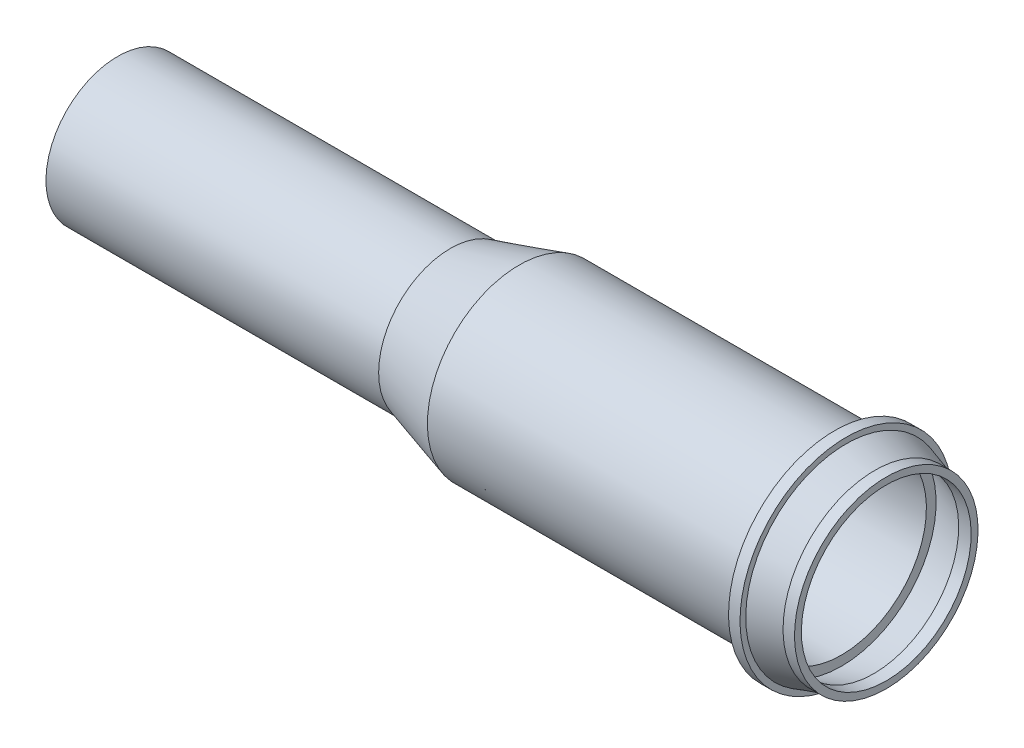
ISO-10303-21;
HEADER;
FILE_DESCRIPTION(('STEP AP214'),'2;1');
FILE_NAME('part.step','',(''),(''),'','','');
FILE_SCHEMA(('AUTOMOTIVE_DESIGN { 1 0 10303 214 1 1 1 1 }'));
ENDSEC;
DATA;
#1=APPLICATION_CONTEXT('core data for automotive mechanical design processes');
#2=APPLICATION_PROTOCOL_DEFINITION('international standard','automotive_design',2000,#1);
#3=PRODUCT_CONTEXT('',#1,'mechanical');
#4=PRODUCT('Part','Part','',(#3));
#5=PRODUCT_RELATED_PRODUCT_CATEGORY('part','',(#4));
#6=PRODUCT_DEFINITION_FORMATION('','',#4);
#7=PRODUCT_DEFINITION_CONTEXT('part definition',#1,'design');
#8=PRODUCT_DEFINITION('design','',#6,#7);
#9=PRODUCT_DEFINITION_SHAPE('','',#8);
#10=(LENGTH_UNIT() NAMED_UNIT(*) SI_UNIT(.MILLI.,.METRE.));
#11=(NAMED_UNIT(*) PLANE_ANGLE_UNIT() SI_UNIT($,.RADIAN.));
#12=(NAMED_UNIT(*) SI_UNIT($,.STERADIAN.) SOLID_ANGLE_UNIT());
#13=UNCERTAINTY_MEASURE_WITH_UNIT(LENGTH_MEASURE(1.E-05),#10,'distance_accuracy_value','');
#14=(GEOMETRIC_REPRESENTATION_CONTEXT(3) GLOBAL_UNCERTAINTY_ASSIGNED_CONTEXT((#13)) GLOBAL_UNIT_ASSIGNED_CONTEXT((#10,
#11,#12)) REPRESENTATION_CONTEXT('',''));
#15=CARTESIAN_POINT('',(0.,0.,0.));
#16=DIRECTION('',(0.,0.,1.));
#17=DIRECTION('',(1.,0.,0.));
#18=AXIS2_PLACEMENT_3D('',#15,#16,#17);
#19=CARTESIAN_POINT('',(126.2,0.,0.));
#20=DIRECTION('',(-1.,0.,0.));
#21=DIRECTION('',(0.,-1.,0.));
#22=AXIS2_PLACEMENT_3D('',#19,#20,#21);
#23=CONICAL_SURFACE('',#22,16.4871632189307,0.291456794477867);
#24=CARTESIAN_POINT('',(126.2,0.,0.));
#25=DIRECTION('',(-1.,0.,0.));
#26=DIRECTION('',(0.,-1.,0.));
#27=AXIS2_PLACEMENT_3D('',#24,#25,#26);
#28=CIRCLE('',#27,16.4871632189307);
#29=CARTESIAN_POINT('',(126.2,-16.4871632189308,0.));
#30=VERTEX_POINT('',#29);
#31=EDGE_CURVE('E19',#30,#30,#28,.F.);
#32=ORIENTED_EDGE('',*,*,#31,.F.);
#33=EDGE_LOOP('',(#32));
#34=FACE_BOUND('',#33,.T.);
#35=CARTESIAN_POINT('',(131.823877396436,0.,0.));
#36=DIRECTION('',(-1.,0.,0.));
#37=DIRECTION('',(0.,-1.,0.));
#38=AXIS2_PLACEMENT_3D('',#35,#36,#37);
#39=CIRCLE('',#38,14.8);
#40=CARTESIAN_POINT('',(131.823877396436,-14.8,0.));
#41=VERTEX_POINT('',#40);
#42=EDGE_CURVE('E45',#41,#41,#39,.F.);
#43=ORIENTED_EDGE('',*,*,#42,.T.);
#44=EDGE_LOOP('',(#43));
#45=FACE_BOUND('',#44,.T.);
#46=ADVANCED_FACE('F16',(#34,#45),#23,.F.);
#47=CARTESIAN_POINT('',(134.,0.,0.));
#48=DIRECTION('',(-1.,0.,0.));
#49=DIRECTION('',(0.,-1.,0.));
#50=AXIS2_PLACEMENT_3D('',#47,#48,#49);
#51=CYLINDRICAL_SURFACE('',#50,14.8);
#52=CARTESIAN_POINT('',(134.,0.,0.));
#53=DIRECTION('',(-1.,0.,0.));
#54=DIRECTION('',(0.,-1.,0.));
#55=AXIS2_PLACEMENT_3D('',#52,#53,#54);
#56=CIRCLE('',#55,14.8);
#57=CARTESIAN_POINT('',(134.,-14.8,0.));
#58=VERTEX_POINT('',#57);
#59=EDGE_CURVE('E65',#58,#58,#56,.F.);
#60=ORIENTED_EDGE('',*,*,#59,.T.);
#61=EDGE_LOOP('',(#60));
#62=FACE_BOUND('',#61,.T.);
#63=ORIENTED_EDGE('',*,*,#42,.F.);
#64=EDGE_LOOP('',(#63));
#65=FACE_BOUND('',#64,.T.);
#66=ADVANCED_FACE('F77',(#62,#65),#51,.F.);
#67=CARTESIAN_POINT('',(126.2,16.,0.));
#68=DIRECTION('',(1.,0.,0.));
#69=DIRECTION('',(0.,1.,0.));
#70=AXIS2_PLACEMENT_3D('',#67,#68,#69);
#71=PLANE('',#70);
#72=ORIENTED_EDGE('',*,*,#31,.T.);
#73=EDGE_LOOP('',(#72));
#74=FACE_BOUND('',#73,.T.);
#75=CARTESIAN_POINT('',(126.2,0.,0.));
#76=DIRECTION('',(-1.,0.,0.));
#77=DIRECTION('',(0.,-1.,0.));
#78=AXIS2_PLACEMENT_3D('',#75,#76,#77);
#79=CIRCLE('',#78,14.8);
#80=CARTESIAN_POINT('',(126.2,-14.8,0.));
#81=VERTEX_POINT('',#80);
#82=EDGE_CURVE('E63',#81,#81,#79,.T.);
#83=ORIENTED_EDGE('',*,*,#82,.T.);
#84=EDGE_LOOP('',(#83));
#85=FACE_BOUND('',#84,.T.);
#86=ADVANCED_FACE('F72',(#74,#85),#71,.T.);
#87=CARTESIAN_POINT('',(134.,16.,0.));
#88=DIRECTION('',(-1.,0.,0.));
#89=DIRECTION('',(0.,-1.,0.));
#90=AXIS2_PLACEMENT_3D('',#87,#88,#89);
#91=PLANE('',#90);
#92=CARTESIAN_POINT('',(134.,0.,0.));
#93=DIRECTION('',(-1.,0.,0.));
#94=DIRECTION('',(0.,-1.,0.));
#95=AXIS2_PLACEMENT_3D('',#92,#93,#94);
#96=CIRCLE('',#95,16.);
#97=CARTESIAN_POINT('',(134.,-16.,0.));
#98=VERTEX_POINT('',#97);
#99=EDGE_CURVE('E44',#98,#98,#96,.T.);
#100=ORIENTED_EDGE('',*,*,#99,.F.);
#101=EDGE_LOOP('',(#100));
#102=FACE_BOUND('',#101,.T.);
#103=ORIENTED_EDGE('',*,*,#59,.F.);
#104=EDGE_LOOP('',(#103));
#105=FACE_BOUND('',#104,.T.);
#106=ADVANCED_FACE('F85',(#102,#105),#91,.F.);
#107=CARTESIAN_POINT('',(134.,0.,0.));
#108=DIRECTION('',(-1.,0.,0.));
#109=DIRECTION('',(0.,-1.,0.));
#110=AXIS2_PLACEMENT_3D('',#107,#108,#109);
#111=CYLINDRICAL_SURFACE('',#110,14.8);
#112=ORIENTED_EDGE('',*,*,#82,.F.);
#113=EDGE_LOOP('',(#112));
#114=FACE_BOUND('',#113,.T.);
#115=CARTESIAN_POINT('',(70.1714285714285,0.,0.));
#116=DIRECTION('',(1.,0.,0.));
#117=DIRECTION('',(0.,1.,0.));
#118=AXIS2_PLACEMENT_3D('',#115,#116,#117);
#119=CIRCLE('',#118,14.8);
#120=CARTESIAN_POINT('',(70.1714285714285,14.7999999999999,0.));
#121=VERTEX_POINT('',#120);
#122=EDGE_CURVE('E41',#121,#121,#119,.F.);
#123=ORIENTED_EDGE('',*,*,#122,.T.);
#124=EDGE_LOOP('',(#123));
#125=FACE_BOUND('',#124,.T.);
#126=ADVANCED_FACE('F133',(#114,#125),#111,.F.);
#127=CARTESIAN_POINT('',(134.,0.,0.));
#128=DIRECTION('',(-1.,0.,0.));
#129=DIRECTION('',(0.,-1.,0.));
#130=AXIS2_PLACEMENT_3D('',#127,#128,#129);
#131=CYLINDRICAL_SURFACE('',#130,16.);
#132=CARTESIAN_POINT('',(132.,0.,0.));
#133=DIRECTION('',(-1.,0.,0.));
#134=DIRECTION('',(0.,-1.,0.));
#135=AXIS2_PLACEMENT_3D('',#132,#133,#134);
#136=CIRCLE('',#135,16.);
#137=CARTESIAN_POINT('',(132.,-16.,0.));
#138=VERTEX_POINT('',#137);
#139=EDGE_CURVE('E38',#138,#138,#136,.T.);
#140=ORIENTED_EDGE('',*,*,#139,.F.);
#141=EDGE_LOOP('',(#140));
#142=FACE_BOUND('',#141,.T.);
#143=ORIENTED_EDGE('',*,*,#99,.T.);
#144=EDGE_LOOP('',(#143));
#145=FACE_BOUND('',#144,.T.);
#146=ADVANCED_FACE('F129',(#142,#145),#131,.T.);
#147=CARTESIAN_POINT('',(70.1714285714285,0.,0.));
#148=DIRECTION('',(1.,0.,0.));
#149=DIRECTION('',(0.,1.,0.));
#150=AXIS2_PLACEMENT_3D('',#147,#148,#149);
#151=CONICAL_SURFACE('',#150,14.8,0.283794109208324);
#152=CARTESIAN_POINT('',(58.1714285714286,0.,0.));
#153=DIRECTION('',(-1.,0.,0.));
#154=DIRECTION('',(0.,-1.,0.));
#155=AXIS2_PLACEMENT_3D('',#152,#153,#154);
#156=CIRCLE('',#155,11.3000000000001);
#157=CARTESIAN_POINT('',(58.1714285714286,-11.3000000000002,0.));
#158=VERTEX_POINT('',#157);
#159=EDGE_CURVE('E34',#158,#158,#156,.T.);
#160=ORIENTED_EDGE('',*,*,#159,.T.);
#161=EDGE_LOOP('',(#160));
#162=FACE_BOUND('',#161,.T.);
#163=ORIENTED_EDGE('',*,*,#122,.F.);
#164=EDGE_LOOP('',(#163));
#165=FACE_BOUND('',#164,.T.);
#166=ADVANCED_FACE('F125',(#162,#165),#151,.F.);
#167=CARTESIAN_POINT('',(127.,0.,0.));
#168=DIRECTION('',(-1.,0.,0.));
#169=DIRECTION('',(0.,-1.,0.));
#170=AXIS2_PLACEMENT_3D('',#167,#168,#169);
#171=CONICAL_SURFACE('',#170,17.5,0.291456794477866);
#172=CARTESIAN_POINT('',(127.,0.,0.));
#173=DIRECTION('',(-1.,0.,0.));
#174=DIRECTION('',(0.,-1.,0.));
#175=AXIS2_PLACEMENT_3D('',#172,#173,#174);
#176=CIRCLE('',#175,17.5);
#177=CARTESIAN_POINT('',(127.,-17.5,0.));
#178=VERTEX_POINT('',#177);
#179=EDGE_CURVE('E37',#178,#178,#176,.F.);
#180=ORIENTED_EDGE('',*,*,#179,.T.);
#181=EDGE_LOOP('',(#180));
#182=FACE_BOUND('',#181,.T.);
#183=ORIENTED_EDGE('',*,*,#139,.T.);
#184=EDGE_LOOP('',(#183));
#185=FACE_BOUND('',#184,.T.);
#186=ADVANCED_FACE('F121',(#182,#185),#171,.T.);
#187=CARTESIAN_POINT('',(134.,0.,0.));
#188=DIRECTION('',(-1.,0.,0.));
#189=DIRECTION('',(0.,-1.,0.));
#190=AXIS2_PLACEMENT_3D('',#187,#188,#189);
#191=CYLINDRICAL_SURFACE('',#190,11.3000000000001);
#192=ORIENTED_EDGE('',*,*,#159,.F.);
#193=EDGE_LOOP('',(#192));
#194=FACE_BOUND('',#193,.T.);
#195=CARTESIAN_POINT('',(0.,-1.06706207682759E-13,0.));
#196=DIRECTION('',(-1.,0.,0.));
#197=DIRECTION('',(0.,-1.,0.));
#198=AXIS2_PLACEMENT_3D('',#195,#196,#197);
#199=CIRCLE('',#198,11.3000000000001);
#200=CARTESIAN_POINT('',(0.,-11.3000000000002,0.));
#201=VERTEX_POINT('',#200);
#202=EDGE_CURVE('E56',#201,#201,#199,.T.);
#203=ORIENTED_EDGE('',*,*,#202,.T.);
#204=EDGE_LOOP('',(#203));
#205=FACE_BOUND('',#204,.T.);
#206=ADVANCED_FACE('F117',(#194,#205),#191,.F.);
#207=CARTESIAN_POINT('',(127.,18.5,0.));
#208=DIRECTION('',(-1.,0.,0.));
#209=DIRECTION('',(0.,-1.,0.));
#210=AXIS2_PLACEMENT_3D('',#207,#208,#209);
#211=PLANE('',#210);
#212=ORIENTED_EDGE('',*,*,#179,.F.);
#213=EDGE_LOOP('',(#212));
#214=FACE_BOUND('',#213,.T.);
#215=CARTESIAN_POINT('',(127.,0.,0.));
#216=DIRECTION('',(-1.,0.,0.));
#217=DIRECTION('',(0.,-1.,0.));
#218=AXIS2_PLACEMENT_3D('',#215,#216,#217);
#219=CIRCLE('',#218,18.5);
#220=CARTESIAN_POINT('',(127.,-18.5,0.));
#221=VERTEX_POINT('',#220);
#222=EDGE_CURVE('E53',#221,#221,#219,.T.);
#223=ORIENTED_EDGE('',*,*,#222,.F.);
#224=EDGE_LOOP('',(#223));
#225=FACE_BOUND('',#224,.T.);
#226=ADVANCED_FACE('F113',(#214,#225),#211,.F.);
#227=CARTESIAN_POINT('',(0.,0.,0.));
#228=DIRECTION('',(1.,0.,0.));
#229=DIRECTION('',(0.,1.,0.));
#230=AXIS2_PLACEMENT_3D('',#227,#228,#229);
#231=PLANE('',#230);
#232=ORIENTED_EDGE('',*,*,#202,.F.);
#233=EDGE_LOOP('',(#232));
#234=FACE_BOUND('',#233,.T.);
#235=CARTESIAN_POINT('',(0.,-1.06706207682759E-13,0.));
#236=DIRECTION('',(-1.,0.,0.));
#237=DIRECTION('',(0.,-1.,0.));
#238=AXIS2_PLACEMENT_3D('',#235,#236,#237);
#239=CIRCLE('',#238,12.5000000000001);
#240=CARTESIAN_POINT('',(0.,-12.5000000000002,0.));
#241=VERTEX_POINT('',#240);
#242=EDGE_CURVE('E50',#241,#241,#239,.F.);
#243=ORIENTED_EDGE('',*,*,#242,.F.);
#244=EDGE_LOOP('',(#243));
#245=FACE_BOUND('',#244,.T.);
#246=ADVANCED_FACE('F109',(#234,#245),#231,.F.);
#247=CARTESIAN_POINT('',(134.,0.,0.));
#248=DIRECTION('',(-1.,0.,0.));
#249=DIRECTION('',(0.,-1.,0.));
#250=AXIS2_PLACEMENT_3D('',#247,#248,#249);
#251=CYLINDRICAL_SURFACE('',#250,18.5);
#252=CARTESIAN_POINT('',(125.,0.,0.));
#253=DIRECTION('',(-1.,0.,0.));
#254=DIRECTION('',(0.,-1.,0.));
#255=AXIS2_PLACEMENT_3D('',#252,#253,#254);
#256=CIRCLE('',#255,18.5);
#257=CARTESIAN_POINT('',(125.,-18.5,0.));
#258=VERTEX_POINT('',#257);
#259=EDGE_CURVE('E33',#258,#258,#256,.F.);
#260=ORIENTED_EDGE('',*,*,#259,.T.);
#261=EDGE_LOOP('',(#260));
#262=FACE_BOUND('',#261,.T.);
#263=ORIENTED_EDGE('',*,*,#222,.T.);
#264=EDGE_LOOP('',(#263));
#265=FACE_BOUND('',#264,.T.);
#266=ADVANCED_FACE('F105',(#262,#265),#251,.T.);
#267=CARTESIAN_POINT('',(134.,0.,0.));
#268=DIRECTION('',(-1.,0.,0.));
#269=DIRECTION('',(0.,-1.,0.));
#270=AXIS2_PLACEMENT_3D('',#267,#268,#269);
#271=CYLINDRICAL_SURFACE('',#270,12.5000000000001);
#272=CARTESIAN_POINT('',(58.,0.,0.));
#273=DIRECTION('',(1.,0.,0.));
#274=DIRECTION('',(0.,1.,0.));
#275=AXIS2_PLACEMENT_3D('',#272,#273,#274);
#276=CIRCLE('',#275,12.5000000000001);
#277=CARTESIAN_POINT('',(58.,12.5,0.));
#278=VERTEX_POINT('',#277);
#279=EDGE_CURVE('E28',#278,#278,#276,.T.);
#280=ORIENTED_EDGE('',*,*,#279,.F.);
#281=EDGE_LOOP('',(#280));
#282=FACE_BOUND('',#281,.T.);
#283=ORIENTED_EDGE('',*,*,#242,.T.);
#284=EDGE_LOOP('',(#283));
#285=FACE_BOUND('',#284,.T.);
#286=ADVANCED_FACE('F101',(#282,#285),#271,.T.);
#287=CARTESIAN_POINT('',(125.,16.,0.));
#288=DIRECTION('',(1.,0.,0.));
#289=DIRECTION('',(0.,1.,0.));
#290=AXIS2_PLACEMENT_3D('',#287,#288,#289);
#291=PLANE('',#290);
#292=ORIENTED_EDGE('',*,*,#259,.F.);
#293=EDGE_LOOP('',(#292));
#294=FACE_BOUND('',#293,.T.);
#295=CARTESIAN_POINT('',(125.,0.,0.));
#296=DIRECTION('',(-1.,0.,0.));
#297=DIRECTION('',(0.,-1.,0.));
#298=AXIS2_PLACEMENT_3D('',#295,#296,#297);
#299=CIRCLE('',#298,16.);
#300=CARTESIAN_POINT('',(125.,-16.,0.));
#301=VERTEX_POINT('',#300);
#302=EDGE_CURVE('E23',#301,#301,#299,.T.);
#303=ORIENTED_EDGE('',*,*,#302,.F.);
#304=EDGE_LOOP('',(#303));
#305=FACE_BOUND('',#304,.T.);
#306=ADVANCED_FACE('F95',(#294,#305),#291,.F.);
#307=CARTESIAN_POINT('',(70.,0.,0.));
#308=DIRECTION('',(1.,0.,0.));
#309=DIRECTION('',(0.,1.,0.));
#310=AXIS2_PLACEMENT_3D('',#307,#308,#309);
#311=CONICAL_SURFACE('',#310,16.,0.283794109208324);
#312=ORIENTED_EDGE('',*,*,#279,.T.);
#313=EDGE_LOOP('',(#312));
#314=FACE_BOUND('',#313,.T.);
#315=CARTESIAN_POINT('',(70.,0.,0.));
#316=DIRECTION('',(-1.,0.,0.));
#317=DIRECTION('',(0.,-1.,0.));
#318=AXIS2_PLACEMENT_3D('',#315,#316,#317);
#319=CIRCLE('',#318,16.);
#320=CARTESIAN_POINT('',(70.,-16.0000000000001,0.));
#321=VERTEX_POINT('',#320);
#322=EDGE_CURVE('E10',#321,#321,#319,.F.);
#323=ORIENTED_EDGE('',*,*,#322,.F.);
#324=EDGE_LOOP('',(#323));
#325=FACE_BOUND('',#324,.T.);
#326=ADVANCED_FACE('F89',(#314,#325),#311,.T.);
#327=CARTESIAN_POINT('',(134.,0.,0.));
#328=DIRECTION('',(-1.,0.,0.));
#329=DIRECTION('',(0.,-1.,0.));
#330=AXIS2_PLACEMENT_3D('',#327,#328,#329);
#331=CYLINDRICAL_SURFACE('',#330,16.);
#332=ORIENTED_EDGE('',*,*,#302,.T.);
#333=EDGE_LOOP('',(#332));
#334=FACE_BOUND('',#333,.T.);
#335=ORIENTED_EDGE('',*,*,#322,.T.);
#336=EDGE_LOOP('',(#335));
#337=FACE_BOUND('',#336,.T.);
#338=ADVANCED_FACE('F87',(#334,#337),#331,.T.);
#339=CLOSED_SHELL('',(#46,#66,#86,#106,#126,#146,#166,#186,#206,#226,#246,#266,#286,#306,#326,#338));
#340=MANIFOLD_SOLID_BREP('B1',#339);
#341=ADVANCED_BREP_SHAPE_REPRESENTATION('',(#18,#340),#14);
#342=SHAPE_DEFINITION_REPRESENTATION(#9,#341);
ENDSEC;
END-ISO-10303-21;
